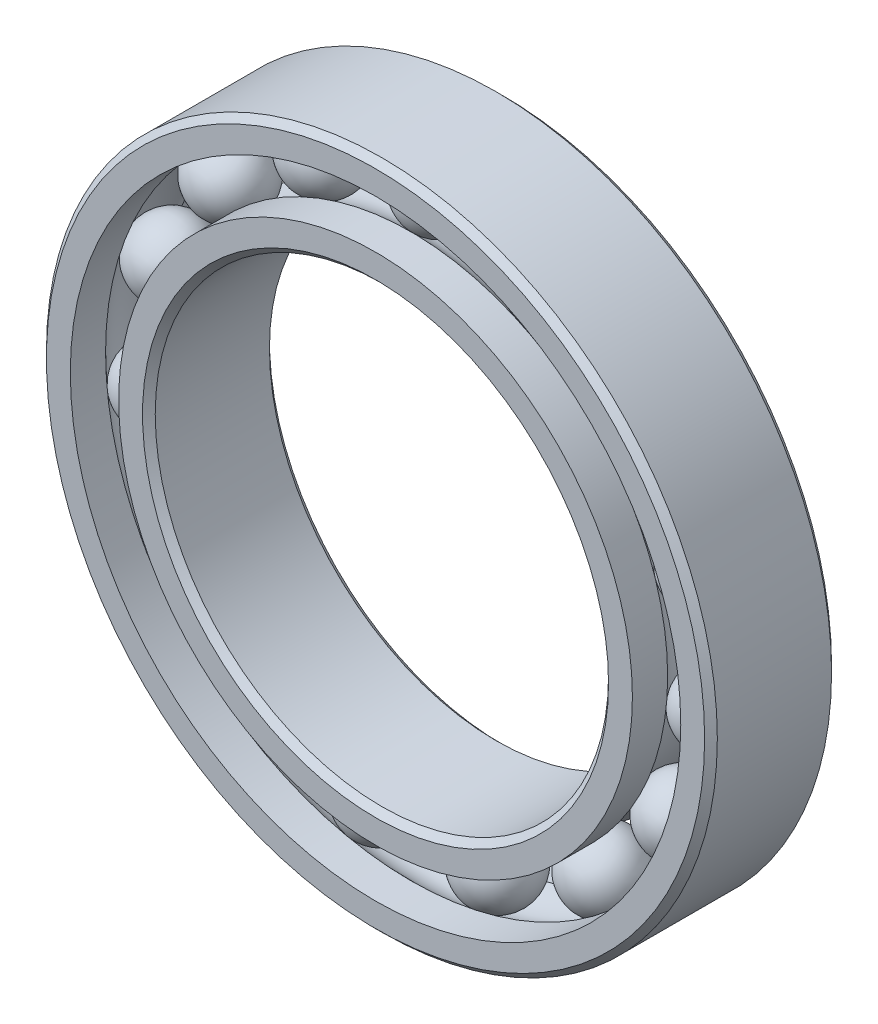
ISO-10303-21;
HEADER;
FILE_DESCRIPTION(('STEP AP214'),'2;1');
FILE_NAME('part.step','',(''),(''),'','','');
FILE_SCHEMA(('AUTOMOTIVE_DESIGN { 1 0 10303 214 1 1 1 1 }'));
ENDSEC;
DATA;
#1=APPLICATION_CONTEXT('core data for automotive mechanical design processes');
#2=APPLICATION_PROTOCOL_DEFINITION('international standard','automotive_design',2000,#1);
#3=PRODUCT_CONTEXT('',#1,'mechanical');
#4=PRODUCT('Part','Part','',(#3));
#5=PRODUCT_RELATED_PRODUCT_CATEGORY('part','',(#4));
#6=PRODUCT_DEFINITION_FORMATION('','',#4);
#7=PRODUCT_DEFINITION_CONTEXT('part definition',#1,'design');
#8=PRODUCT_DEFINITION('design','',#6,#7);
#9=PRODUCT_DEFINITION_SHAPE('','',#8);
#10=(LENGTH_UNIT() NAMED_UNIT(*) SI_UNIT(.MILLI.,.METRE.));
#11=(NAMED_UNIT(*) PLANE_ANGLE_UNIT() SI_UNIT($,.RADIAN.));
#12=(NAMED_UNIT(*) SI_UNIT($,.STERADIAN.) SOLID_ANGLE_UNIT());
#13=UNCERTAINTY_MEASURE_WITH_UNIT(LENGTH_MEASURE(1.E-05),#10,'distance_accuracy_value','');
#14=(GEOMETRIC_REPRESENTATION_CONTEXT(3) GLOBAL_UNCERTAINTY_ASSIGNED_CONTEXT((#13)) GLOBAL_UNIT_ASSIGNED_CONTEXT((#10,
#11,#12)) REPRESENTATION_CONTEXT('',''));
#15=CARTESIAN_POINT('',(0.,0.,0.));
#16=DIRECTION('',(0.,0.,1.));
#17=DIRECTION('',(1.,0.,0.));
#18=AXIS2_PLACEMENT_3D('',#15,#16,#17);
#19=CARTESIAN_POINT('',(6.30441796767473,14.1599545934604,0.));
#20=DIRECTION('',(0.,0.,1.));
#21=DIRECTION('',(0.406736643075789,0.913545457642606,0.));
#22=AXIS2_PLACEMENT_3D('',#19,#20,#21);
#23=SPHERICAL_SURFACE('',#22,2.0487876571762);
#24=CARTESIAN_POINT('',(6.30441796767473,14.1599545934604,2.0487876571762));
#25=VERTEX_POINT('',#24);
#26=VERTEX_LOOP('',#25);
#27=FACE_BOUND('',#26,.T.);
#28=ADVANCED_FACE('F39',(#27),#23,.T.);
#29=CLOSED_SHELL('',(#28));
#30=MANIFOLD_SOLID_BREP('B2',#29);
#31=CARTESIAN_POINT('',(11.5187447948995,10.3715243985624,0.));
#32=DIRECTION('',(0.,0.,1.));
#33=DIRECTION('',(0.743144825477386,0.669130606358867,0.));
#34=AXIS2_PLACEMENT_3D('',#31,#32,#33);
#35=SPHERICAL_SURFACE('',#34,2.0487876571762);
#36=CARTESIAN_POINT('',(11.5187447948995,10.3715243985624,2.0487876571762));
#37=VERTEX_POINT('',#36);
#38=VERTEX_LOOP('',#37);
#39=FACE_BOUND('',#38,.T.);
#40=ADVANCED_FACE('F59',(#39),#35,.T.);
#41=CLOSED_SHELL('',(#40));
#42=MANIFOLD_SOLID_BREP('B6',#41);
#43=CARTESIAN_POINT('',(14.7413760025748,4.78976341281184,0.));
#44=DIRECTION('',(0.,0.,1.));
#45=DIRECTION('',(0.95105651629515,0.309016994374957,0.));
#46=AXIS2_PLACEMENT_3D('',#43,#44,#45);
#47=SPHERICAL_SURFACE('',#46,2.0487876571762);
#48=CARTESIAN_POINT('',(14.7413760025748,4.78976341281184,2.0487876571762));
#49=VERTEX_POINT('',#48);
#50=VERTEX_LOOP('',#49);
#51=FACE_BOUND('',#50,.T.);
#52=ADVANCED_FACE('F79',(#51),#47,.T.);
#53=CLOSED_SHELL('',(#52));
#54=MANIFOLD_SOLID_BREP('B35',#53);
#55=CARTESIAN_POINT('',(15.4150893782083,-1.62019118064848,0.));
#56=DIRECTION('',(0.,0.,1.));
#57=DIRECTION('',(0.994521895368274,-0.104528463267644,0.));
#58=AXIS2_PLACEMENT_3D('',#55,#56,#57);
#59=SPHERICAL_SURFACE('',#58,2.0487876571762);
#60=CARTESIAN_POINT('',(15.4150893782083,-1.62019118064848,2.0487876571762));
#61=VERTEX_POINT('',#60);
#62=VERTEX_LOOP('',#61);
#63=FACE_BOUND('',#62,.T.);
#64=ADVANCED_FACE('F99',(#63),#59,.T.);
#65=CLOSED_SHELL('',(#64));
#66=MANIFOLD_SOLID_BREP('B55',#65);
#67=CARTESIAN_POINT('',(13.4233937586589,-7.74999999999987,0.));
#68=DIRECTION('',(0.,0.,1.));
#69=DIRECTION('',(0.866025403784443,-0.499999999999992,0.));
#70=AXIS2_PLACEMENT_3D('',#67,#68,#69);
#71=SPHERICAL_SURFACE('',#70,2.0487876571762);
#72=CARTESIAN_POINT('',(13.4233937586589,-7.74999999999987,2.0487876571762));
#73=VERTEX_POINT('',#72);
#74=VERTEX_LOOP('',#73);
#75=FACE_BOUND('',#74,.T.);
#76=ADVANCED_FACE('F119',(#75),#71,.T.);
#77=CLOSED_SHELL('',(#76));
#78=MANIFOLD_SOLID_BREP('B75',#77);
#79=CARTESIAN_POINT('',(9.11067141053344,-12.5397634128116,0.));
#80=DIRECTION('',(0.,0.,1.));
#81=DIRECTION('',(0.58778525229248,-0.809016994374943,0.));
#82=AXIS2_PLACEMENT_3D('',#79,#80,#81);
#83=SPHERICAL_SURFACE('',#82,2.0487876571762);
#84=CARTESIAN_POINT('',(9.11067141053344,-12.5397634128116,2.0487876571762));
#85=VERTEX_POINT('',#84);
#86=VERTEX_LOOP('',#85);
#87=FACE_BOUND('',#86,.T.);
#88=ADVANCED_FACE('F139',(#87),#83,.T.);
#89=CLOSED_SHELL('',(#88));
#90=MANIFOLD_SOLID_BREP('B95',#89);
#91=CARTESIAN_POINT('',(3.22263120767538,-15.161287811374,0.));
#92=DIRECTION('',(0.,0.,1.));
#93=DIRECTION('',(0.207911690817766,-0.978147600733804,0.));
#94=AXIS2_PLACEMENT_3D('',#91,#92,#93);
#95=SPHERICAL_SURFACE('',#94,2.0487876571762);
#96=CARTESIAN_POINT('',(3.22263120767538,-15.161287811374,2.0487876571762));
#97=VERTEX_POINT('',#96);
#98=VERTEX_LOOP('',#97);
#99=FACE_BOUND('',#98,.T.);
#100=ADVANCED_FACE('F159',(#99),#95,.T.);
#101=CLOSED_SHELL('',(#100));
#102=MANIFOLD_SOLID_BREP('B115',#101);
#103=CARTESIAN_POINT('',(-3.22263120767518,-15.161287811374,0.));
#104=DIRECTION('',(0.,0.,1.));
#105=DIRECTION('',(-0.207911690817753,-0.978147600733807,0.));
#106=AXIS2_PLACEMENT_3D('',#103,#104,#105);
#107=SPHERICAL_SURFACE('',#106,2.0487876571762);
#108=CARTESIAN_POINT('',(-3.22263120767518,-15.161287811374,2.0487876571762));
#109=VERTEX_POINT('',#108);
#110=VERTEX_LOOP('',#109);
#111=FACE_BOUND('',#110,.T.);
#112=ADVANCED_FACE('F179',(#111),#107,.T.);
#113=CLOSED_SHELL('',(#112));
#114=MANIFOLD_SOLID_BREP('B135',#113);
#115=CARTESIAN_POINT('',(-9.11067141053327,-12.5397634128117,0.));
#116=DIRECTION('',(0.,0.,1.));
#117=DIRECTION('',(-0.587785252292469,-0.80901699437495,0.));
#118=AXIS2_PLACEMENT_3D('',#115,#116,#117);
#119=SPHERICAL_SURFACE('',#118,2.0487876571762);
#120=CARTESIAN_POINT('',(-9.11067141053327,-12.5397634128117,2.0487876571762));
#121=VERTEX_POINT('',#120);
#122=VERTEX_LOOP('',#121);
#123=FACE_BOUND('',#122,.T.);
#124=ADVANCED_FACE('F199',(#123),#119,.T.);
#125=CLOSED_SHELL('',(#124));
#126=MANIFOLD_SOLID_BREP('B155',#125);
#127=CARTESIAN_POINT('',(-13.4233937586588,-7.75000000000006,0.));
#128=DIRECTION('',(0.,0.,1.));
#129=DIRECTION('',(-0.866025403784436,-0.500000000000004,0.));
#130=AXIS2_PLACEMENT_3D('',#127,#128,#129);
#131=SPHERICAL_SURFACE('',#130,2.0487876571762);
#132=CARTESIAN_POINT('',(-13.4233937586588,-7.75000000000006,2.0487876571762));
#133=VERTEX_POINT('',#132);
#134=VERTEX_LOOP('',#133);
#135=FACE_BOUND('',#134,.T.);
#136=ADVANCED_FACE('F219',(#135),#131,.T.);
#137=CLOSED_SHELL('',(#136));
#138=MANIFOLD_SOLID_BREP('B175',#137);
#139=CARTESIAN_POINT('',(-15.4150893782082,-1.62019118064869,0.));
#140=DIRECTION('',(0.,0.,1.));
#141=DIRECTION('',(-0.994521895368273,-0.104528463267657,0.));
#142=AXIS2_PLACEMENT_3D('',#139,#140,#141);
#143=SPHERICAL_SURFACE('',#142,2.0487876571762);
#144=CARTESIAN_POINT('',(-15.4150893782082,-1.62019118064869,2.0487876571762));
#145=VERTEX_POINT('',#144);
#146=VERTEX_LOOP('',#145);
#147=FACE_BOUND('',#146,.T.);
#148=ADVANCED_FACE('F239',(#147),#143,.T.);
#149=CLOSED_SHELL('',(#148));
#150=MANIFOLD_SOLID_BREP('B195',#149);
#151=CARTESIAN_POINT('',(-14.7413760025749,4.78976341281165,0.));
#152=DIRECTION('',(0.,0.,1.));
#153=DIRECTION('',(-0.951056516295154,0.309016994374945,0.));
#154=AXIS2_PLACEMENT_3D('',#151,#152,#153);
#155=SPHERICAL_SURFACE('',#154,2.0487876571762);
#156=CARTESIAN_POINT('',(-14.7413760025749,4.78976341281165,2.0487876571762));
#157=VERTEX_POINT('',#156);
#158=VERTEX_LOOP('',#157);
#159=FACE_BOUND('',#158,.T.);
#160=ADVANCED_FACE('F259',(#159),#155,.T.);
#161=CLOSED_SHELL('',(#160));
#162=MANIFOLD_SOLID_BREP('B215',#161);
#163=CARTESIAN_POINT('',(-11.5187447948996,10.3715243985623,0.));
#164=DIRECTION('',(0.,0.,1.));
#165=DIRECTION('',(-0.743144825477395,0.669130606358857,0.));
#166=AXIS2_PLACEMENT_3D('',#163,#164,#165);
#167=SPHERICAL_SURFACE('',#166,2.0487876571762);
#168=CARTESIAN_POINT('',(-11.5187447948996,10.3715243985623,2.0487876571762));
#169=VERTEX_POINT('',#168);
#170=VERTEX_LOOP('',#169);
#171=FACE_BOUND('',#170,.T.);
#172=ADVANCED_FACE('F279',(#171),#167,.T.);
#173=CLOSED_SHELL('',(#172));
#174=MANIFOLD_SOLID_BREP('B235',#173);
#175=CARTESIAN_POINT('',(-6.30441796767492,14.1599545934603,0.));
#176=DIRECTION('',(0.,0.,1.));
#177=DIRECTION('',(-0.406736643075801,0.913545457642601,0.));
#178=AXIS2_PLACEMENT_3D('',#175,#176,#177);
#179=SPHERICAL_SURFACE('',#178,2.0487876571762);
#180=CARTESIAN_POINT('',(-6.30441796767492,14.1599545934603,2.0487876571762));
#181=VERTEX_POINT('',#180);
#182=VERTEX_LOOP('',#181);
#183=FACE_BOUND('',#182,.T.);
#184=ADVANCED_FACE('F299',(#183),#179,.T.);
#185=CLOSED_SHELL('',(#184));
#186=MANIFOLD_SOLID_BREP('B255',#185);
#187=CARTESIAN_POINT('',(0.,15.5,0.));
#188=DIRECTION('',(0.,0.,1.));
#189=DIRECTION('',(0.,1.,0.));
#190=AXIS2_PLACEMENT_3D('',#187,#188,#189);
#191=SPHERICAL_SURFACE('',#190,2.0487876571762);
#192=CARTESIAN_POINT('',(0.,15.5,2.0487876571762));
#193=VERTEX_POINT('',#192);
#194=VERTEX_LOOP('',#193);
#195=FACE_BOUND('',#194,.T.);
#196=ADVANCED_FACE('F321',(#195),#191,.T.);
#197=CLOSED_SHELL('',(#196));
#198=MANIFOLD_SOLID_BREP('B275',#197);
#199=CARTESIAN_POINT('',(0.,14.1666666666667,3.5));
#200=DIRECTION('',(0.,0.,-1.));
#201=DIRECTION('',(-1.,0.,0.));
#202=AXIS2_PLACEMENT_3D('',#199,#200,#201);
#203=PLANE('',#202);
#204=CARTESIAN_POINT('',(0.,0.,3.5));
#205=DIRECTION('',(0.,0.,1.));
#206=DIRECTION('',(1.,0.,0.));
#207=AXIS2_PLACEMENT_3D('',#204,#205,#206);
#208=CIRCLE('',#207,12.85);
#209=CARTESIAN_POINT('',(12.85,0.,3.5));
#210=VERTEX_POINT('',#209);
#211=EDGE_CURVE('E368',#210,#210,#208,.T.);
#212=ORIENTED_EDGE('',*,*,#211,.F.);
#213=EDGE_LOOP('',(#212));
#214=FACE_BOUND('',#213,.T.);
#215=CARTESIAN_POINT('',(0.,0.,3.5));
#216=DIRECTION('',(0.,0.,1.));
#217=DIRECTION('',(1.,0.,0.));
#218=AXIS2_PLACEMENT_3D('',#215,#216,#217);
#219=CIRCLE('',#218,14.1666666666667);
#220=CARTESIAN_POINT('',(14.1666666666667,0.,3.5));
#221=VERTEX_POINT('',#220);
#222=EDGE_CURVE('E320',#221,#221,#219,.T.);
#223=ORIENTED_EDGE('',*,*,#222,.T.);
#224=EDGE_LOOP('',(#223));
#225=FACE_BOUND('',#224,.T.);
#226=ADVANCED_FACE('F340',(#214,#225),#203,.F.);
#227=CARTESIAN_POINT('',(0.,0.,3.5));
#228=DIRECTION('',(0.,0.,1.));
#229=DIRECTION('',(1.,0.,0.));
#230=AXIS2_PLACEMENT_3D('',#227,#228,#229);
#231=CYLINDRICAL_SURFACE('',#230,14.1666666666667);
#232=ORIENTED_EDGE('',*,*,#222,.F.);
#233=EDGE_LOOP('',(#232));
#234=FACE_BOUND('',#233,.T.);
#235=CARTESIAN_POINT('',(0.,0.,1.55555555555556));
#236=DIRECTION('',(0.,0.,1.));
#237=DIRECTION('',(1.,0.,0.));
#238=AXIS2_PLACEMENT_3D('',#235,#236,#237);
#239=CIRCLE('',#238,14.1666666666667);
#240=CARTESIAN_POINT('',(14.1666666666667,0.,1.55555555555556));
#241=VERTEX_POINT('',#240);
#242=EDGE_CURVE('E346',#241,#241,#239,.T.);
#243=ORIENTED_EDGE('',*,*,#242,.T.);
#244=EDGE_LOOP('',(#243));
#245=FACE_BOUND('',#244,.T.);
#246=ADVANCED_FACE('F375',(#234,#245),#231,.T.);
#247=CARTESIAN_POINT('',(0.,0.,0.));
#248=DIRECTION('',(0.,0.,1.));
#249=DIRECTION('',(1.,0.,0.));
#250=AXIS2_PLACEMENT_3D('',#247,#248,#249);
#251=TOROIDAL_SURFACE('',#250,15.5,2.0487876571762);
#252=ORIENTED_EDGE('',*,*,#242,.F.);
#253=EDGE_LOOP('',(#252));
#254=FACE_BOUND('',#253,.T.);
#255=CARTESIAN_POINT('',(0.,0.,-1.55555555555556));
#256=DIRECTION('',(0.,0.,1.));
#257=DIRECTION('',(1.,0.,0.));
#258=AXIS2_PLACEMENT_3D('',#255,#256,#257);
#259=CIRCLE('',#258,14.1666666666667);
#260=CARTESIAN_POINT('',(14.1666666666667,0.,-1.55555555555556));
#261=VERTEX_POINT('',#260);
#262=EDGE_CURVE('E350',#261,#261,#259,.T.);
#263=ORIENTED_EDGE('',*,*,#262,.T.);
#264=EDGE_LOOP('',(#263));
#265=FACE_BOUND('',#264,.T.);
#266=ADVANCED_FACE('F379',(#254,#265),#251,.F.);
#267=CARTESIAN_POINT('',(0.,0.,3.5));
#268=DIRECTION('',(0.,0.,1.));
#269=DIRECTION('',(1.,0.,0.));
#270=AXIS2_PLACEMENT_3D('',#267,#268,#269);
#271=CYLINDRICAL_SURFACE('',#270,14.1666666666667);
#272=ORIENTED_EDGE('',*,*,#262,.F.);
#273=EDGE_LOOP('',(#272));
#274=FACE_BOUND('',#273,.T.);
#275=CARTESIAN_POINT('',(0.,0.,-3.5));
#276=DIRECTION('',(0.,0.,1.));
#277=DIRECTION('',(1.,0.,0.));
#278=AXIS2_PLACEMENT_3D('',#275,#276,#277);
#279=CIRCLE('',#278,14.1666666666667);
#280=CARTESIAN_POINT('',(14.1666666666667,0.,-3.5));
#281=VERTEX_POINT('',#280);
#282=EDGE_CURVE('E354',#281,#281,#279,.T.);
#283=ORIENTED_EDGE('',*,*,#282,.T.);
#284=EDGE_LOOP('',(#283));
#285=FACE_BOUND('',#284,.T.);
#286=ADVANCED_FACE('F384',(#274,#285),#271,.T.);
#287=CARTESIAN_POINT('',(0.,12.85,-3.5));
#288=DIRECTION('',(0.,0.,1.));
#289=DIRECTION('',(1.,0.,0.));
#290=AXIS2_PLACEMENT_3D('',#287,#288,#289);
#291=PLANE('',#290);
#292=ORIENTED_EDGE('',*,*,#282,.F.);
#293=EDGE_LOOP('',(#292));
#294=FACE_BOUND('',#293,.T.);
#295=CARTESIAN_POINT('',(0.,0.,-3.5));
#296=DIRECTION('',(0.,0.,1.));
#297=DIRECTION('',(1.,0.,0.));
#298=AXIS2_PLACEMENT_3D('',#295,#296,#297);
#299=CIRCLE('',#298,12.85);
#300=CARTESIAN_POINT('',(12.85,0.,-3.5));
#301=VERTEX_POINT('',#300);
#302=EDGE_CURVE('E359',#301,#301,#299,.T.);
#303=ORIENTED_EDGE('',*,*,#302,.T.);
#304=EDGE_LOOP('',(#303));
#305=FACE_BOUND('',#304,.T.);
#306=ADVANCED_FACE('F390',(#294,#305),#291,.F.);
#307=CARTESIAN_POINT('',(0.,0.,-3.15));
#308=DIRECTION('',(0.,0.,-1.));
#309=DIRECTION('',(-1.,0.,0.));
#310=AXIS2_PLACEMENT_3D('',#307,#308,#309);
#311=CONICAL_SURFACE('',#310,12.5,0.785398163397448);
#312=ORIENTED_EDGE('',*,*,#302,.F.);
#313=EDGE_LOOP('',(#312));
#314=FACE_BOUND('',#313,.T.);
#315=CARTESIAN_POINT('',(0.,0.,-3.15));
#316=DIRECTION('',(0.,0.,1.));
#317=DIRECTION('',(1.,0.,0.));
#318=AXIS2_PLACEMENT_3D('',#315,#316,#317);
#319=CIRCLE('',#318,12.5);
#320=CARTESIAN_POINT('',(12.5,0.,-3.15));
#321=VERTEX_POINT('',#320);
#322=EDGE_CURVE('E362',#321,#321,#319,.T.);
#323=ORIENTED_EDGE('',*,*,#322,.T.);
#324=EDGE_LOOP('',(#323));
#325=FACE_BOUND('',#324,.T.);
#326=ADVANCED_FACE('F394',(#314,#325),#311,.F.);
#327=CARTESIAN_POINT('',(0.,0.,3.5));
#328=DIRECTION('',(0.,0.,1.));
#329=DIRECTION('',(1.,0.,0.));
#330=AXIS2_PLACEMENT_3D('',#327,#328,#329);
#331=CYLINDRICAL_SURFACE('',#330,12.5);
#332=ORIENTED_EDGE('',*,*,#322,.F.);
#333=EDGE_LOOP('',(#332));
#334=FACE_BOUND('',#333,.T.);
#335=CARTESIAN_POINT('',(0.,0.,3.15));
#336=DIRECTION('',(0.,0.,1.));
#337=DIRECTION('',(1.,0.,0.));
#338=AXIS2_PLACEMENT_3D('',#335,#336,#337);
#339=CIRCLE('',#338,12.5);
#340=CARTESIAN_POINT('',(12.5,0.,3.15));
#341=VERTEX_POINT('',#340);
#342=EDGE_CURVE('E365',#341,#341,#339,.T.);
#343=ORIENTED_EDGE('',*,*,#342,.T.);
#344=EDGE_LOOP('',(#343));
#345=FACE_BOUND('',#344,.T.);
#346=ADVANCED_FACE('F398',(#334,#345),#331,.F.);
#347=CARTESIAN_POINT('',(0.,0.,3.5));
#348=DIRECTION('',(0.,0.,1.));
#349=DIRECTION('',(1.,0.,0.));
#350=AXIS2_PLACEMENT_3D('',#347,#348,#349);
#351=CONICAL_SURFACE('',#350,12.85,0.785398163397448);
#352=ORIENTED_EDGE('',*,*,#342,.F.);
#353=EDGE_LOOP('',(#352));
#354=FACE_BOUND('',#353,.T.);
#355=ORIENTED_EDGE('',*,*,#211,.T.);
#356=EDGE_LOOP('',(#355));
#357=FACE_BOUND('',#356,.T.);
#358=ADVANCED_FACE('F372',(#354,#357),#351,.F.);
#359=CLOSED_SHELL('',(#226,#246,#266,#286,#306,#326,#346,#358));
#360=MANIFOLD_SOLID_BREP('B295',#359);
#361=CARTESIAN_POINT('',(0.,0.,3.15));
#362=DIRECTION('',(0.,0.,-1.));
#363=DIRECTION('',(-1.,0.,0.));
#364=AXIS2_PLACEMENT_3D('',#361,#362,#363);
#365=CONICAL_SURFACE('',#364,18.5,0.785398163397447);
#366=CARTESIAN_POINT('',(0.,0.,3.5));
#367=DIRECTION('',(0.,0.,1.));
#368=DIRECTION('',(1.,0.,0.));
#369=AXIS2_PLACEMENT_3D('',#366,#367,#368);
#370=CIRCLE('',#369,18.15);
#371=CARTESIAN_POINT('',(18.15,0.,3.5));
#372=VERTEX_POINT('',#371);
#373=EDGE_CURVE('E489',#372,#372,#370,.T.);
#374=ORIENTED_EDGE('',*,*,#373,.F.);
#375=EDGE_LOOP('',(#374));
#376=FACE_BOUND('',#375,.T.);
#377=CARTESIAN_POINT('',(0.,0.,3.15));
#378=DIRECTION('',(0.,0.,1.));
#379=DIRECTION('',(1.,0.,0.));
#380=AXIS2_PLACEMENT_3D('',#377,#378,#379);
#381=CIRCLE('',#380,18.5);
#382=CARTESIAN_POINT('',(18.5,0.,3.15));
#383=VERTEX_POINT('',#382);
#384=EDGE_CURVE('E339',#383,#383,#381,.T.);
#385=ORIENTED_EDGE('',*,*,#384,.T.);
#386=EDGE_LOOP('',(#385));
#387=FACE_BOUND('',#386,.T.);
#388=ADVANCED_FACE('F461',(#376,#387),#365,.T.);
#389=CARTESIAN_POINT('',(0.,0.,3.5));
#390=DIRECTION('',(0.,0.,1.));
#391=DIRECTION('',(1.,0.,0.));
#392=AXIS2_PLACEMENT_3D('',#389,#390,#391);
#393=CYLINDRICAL_SURFACE('',#392,18.5);
#394=ORIENTED_EDGE('',*,*,#384,.F.);
#395=EDGE_LOOP('',(#394));
#396=FACE_BOUND('',#395,.T.);
#397=CARTESIAN_POINT('',(0.,0.,-3.15));
#398=DIRECTION('',(0.,0.,1.));
#399=DIRECTION('',(1.,0.,0.));
#400=AXIS2_PLACEMENT_3D('',#397,#398,#399);
#401=CIRCLE('',#400,18.5);
#402=CARTESIAN_POINT('',(18.5,0.,-3.15));
#403=VERTEX_POINT('',#402);
#404=EDGE_CURVE('E467',#403,#403,#401,.T.);
#405=ORIENTED_EDGE('',*,*,#404,.T.);
#406=EDGE_LOOP('',(#405));
#407=FACE_BOUND('',#406,.T.);
#408=ADVANCED_FACE('F496',(#396,#407),#393,.T.);
#409=CARTESIAN_POINT('',(0.,0.,-3.5));
#410=DIRECTION('',(0.,0.,1.));
#411=DIRECTION('',(1.,0.,0.));
#412=AXIS2_PLACEMENT_3D('',#409,#410,#411);
#413=CONICAL_SURFACE('',#412,18.15,0.785398163397448);
#414=ORIENTED_EDGE('',*,*,#404,.F.);
#415=EDGE_LOOP('',(#414));
#416=FACE_BOUND('',#415,.T.);
#417=CARTESIAN_POINT('',(0.,0.,-3.5));
#418=DIRECTION('',(0.,0.,1.));
#419=DIRECTION('',(1.,0.,0.));
#420=AXIS2_PLACEMENT_3D('',#417,#418,#419);
#421=CIRCLE('',#420,18.15);
#422=CARTESIAN_POINT('',(18.15,0.,-3.5));
#423=VERTEX_POINT('',#422);
#424=EDGE_CURVE('E471',#423,#423,#421,.T.);
#425=ORIENTED_EDGE('',*,*,#424,.T.);
#426=EDGE_LOOP('',(#425));
#427=FACE_BOUND('',#426,.T.);
#428=ADVANCED_FACE('F500',(#416,#427),#413,.T.);
#429=CARTESIAN_POINT('',(0.,18.15,-3.5));
#430=DIRECTION('',(0.,0.,1.));
#431=DIRECTION('',(1.,0.,0.));
#432=AXIS2_PLACEMENT_3D('',#429,#430,#431);
#433=PLANE('',#432);
#434=ORIENTED_EDGE('',*,*,#424,.F.);
#435=EDGE_LOOP('',(#434));
#436=FACE_BOUND('',#435,.T.);
#437=CARTESIAN_POINT('',(0.,0.,-3.5));
#438=DIRECTION('',(0.,0.,1.));
#439=DIRECTION('',(1.,0.,0.));
#440=AXIS2_PLACEMENT_3D('',#437,#438,#439);
#441=CIRCLE('',#440,16.8333333333333);
#442=CARTESIAN_POINT('',(16.8333333333333,0.,-3.5));
#443=VERTEX_POINT('',#442);
#444=EDGE_CURVE('E475',#443,#443,#441,.T.);
#445=ORIENTED_EDGE('',*,*,#444,.T.);
#446=EDGE_LOOP('',(#445));
#447=FACE_BOUND('',#446,.T.);
#448=ADVANCED_FACE('F505',(#436,#447),#433,.F.);
#449=CARTESIAN_POINT('',(0.,0.,3.5));
#450=DIRECTION('',(0.,0.,1.));
#451=DIRECTION('',(1.,0.,0.));
#452=AXIS2_PLACEMENT_3D('',#449,#450,#451);
#453=CYLINDRICAL_SURFACE('',#452,16.8333333333333);
#454=ORIENTED_EDGE('',*,*,#444,.F.);
#455=EDGE_LOOP('',(#454));
#456=FACE_BOUND('',#455,.T.);
#457=CARTESIAN_POINT('',(0.,0.,-1.55555555555556));
#458=DIRECTION('',(0.,0.,1.));
#459=DIRECTION('',(1.,0.,0.));
#460=AXIS2_PLACEMENT_3D('',#457,#458,#459);
#461=CIRCLE('',#460,16.8333333333333);
#462=CARTESIAN_POINT('',(16.8333333333333,0.,-1.55555555555556));
#463=VERTEX_POINT('',#462);
#464=EDGE_CURVE('E480',#463,#463,#461,.T.);
#465=ORIENTED_EDGE('',*,*,#464,.T.);
#466=EDGE_LOOP('',(#465));
#467=FACE_BOUND('',#466,.T.);
#468=ADVANCED_FACE('F511',(#456,#467),#453,.F.);
#469=CARTESIAN_POINT('',(0.,0.,0.));
#470=DIRECTION('',(0.,0.,1.));
#471=DIRECTION('',(1.,0.,0.));
#472=AXIS2_PLACEMENT_3D('',#469,#470,#471);
#473=TOROIDAL_SURFACE('',#472,15.5,2.0487876571762);
#474=ORIENTED_EDGE('',*,*,#464,.F.);
#475=EDGE_LOOP('',(#474));
#476=FACE_BOUND('',#475,.T.);
#477=CARTESIAN_POINT('',(0.,0.,1.55555555555556));
#478=DIRECTION('',(0.,0.,1.));
#479=DIRECTION('',(1.,0.,0.));
#480=AXIS2_PLACEMENT_3D('',#477,#478,#479);
#481=CIRCLE('',#480,16.8333333333333);
#482=CARTESIAN_POINT('',(16.8333333333333,0.,1.55555555555556));
#483=VERTEX_POINT('',#482);
#484=EDGE_CURVE('E483',#483,#483,#481,.T.);
#485=ORIENTED_EDGE('',*,*,#484,.T.);
#486=EDGE_LOOP('',(#485));
#487=FACE_BOUND('',#486,.T.);
#488=ADVANCED_FACE('F515',(#476,#487),#473,.F.);
#489=CARTESIAN_POINT('',(0.,0.,3.5));
#490=DIRECTION('',(0.,0.,1.));
#491=DIRECTION('',(1.,0.,0.));
#492=AXIS2_PLACEMENT_3D('',#489,#490,#491);
#493=CYLINDRICAL_SURFACE('',#492,16.8333333333333);
#494=ORIENTED_EDGE('',*,*,#484,.F.);
#495=EDGE_LOOP('',(#494));
#496=FACE_BOUND('',#495,.T.);
#497=CARTESIAN_POINT('',(0.,0.,3.5));
#498=DIRECTION('',(0.,0.,1.));
#499=DIRECTION('',(1.,0.,0.));
#500=AXIS2_PLACEMENT_3D('',#497,#498,#499);
#501=CIRCLE('',#500,16.8333333333333);
#502=CARTESIAN_POINT('',(16.8333333333333,0.,3.5));
#503=VERTEX_POINT('',#502);
#504=EDGE_CURVE('E486',#503,#503,#501,.T.);
#505=ORIENTED_EDGE('',*,*,#504,.T.);
#506=EDGE_LOOP('',(#505));
#507=FACE_BOUND('',#506,.T.);
#508=ADVANCED_FACE('F519',(#496,#507),#493,.F.);
#509=CARTESIAN_POINT('',(0.,18.15,3.5));
#510=DIRECTION('',(0.,0.,-1.));
#511=DIRECTION('',(-1.,0.,0.));
#512=AXIS2_PLACEMENT_3D('',#509,#510,#511);
#513=PLANE('',#512);
#514=ORIENTED_EDGE('',*,*,#504,.F.);
#515=EDGE_LOOP('',(#514));
#516=FACE_BOUND('',#515,.T.);
#517=ORIENTED_EDGE('',*,*,#373,.T.);
#518=EDGE_LOOP('',(#517));
#519=FACE_BOUND('',#518,.T.);
#520=ADVANCED_FACE('F493',(#516,#519),#513,.F.);
#521=CLOSED_SHELL('',(#388,#408,#428,#448,#468,#488,#508,#520));
#522=MANIFOLD_SOLID_BREP('B315',#521);
#523=ADVANCED_BREP_SHAPE_REPRESENTATION('',(#18,#30,#42,#54,#66,#78,#90,#102,#114,#126,#138,
#150,#162,#174,#186,#198,#360,#522),#14);
#524=SHAPE_DEFINITION_REPRESENTATION(#9,#523);
ENDSEC;
END-ISO-10303-21;
